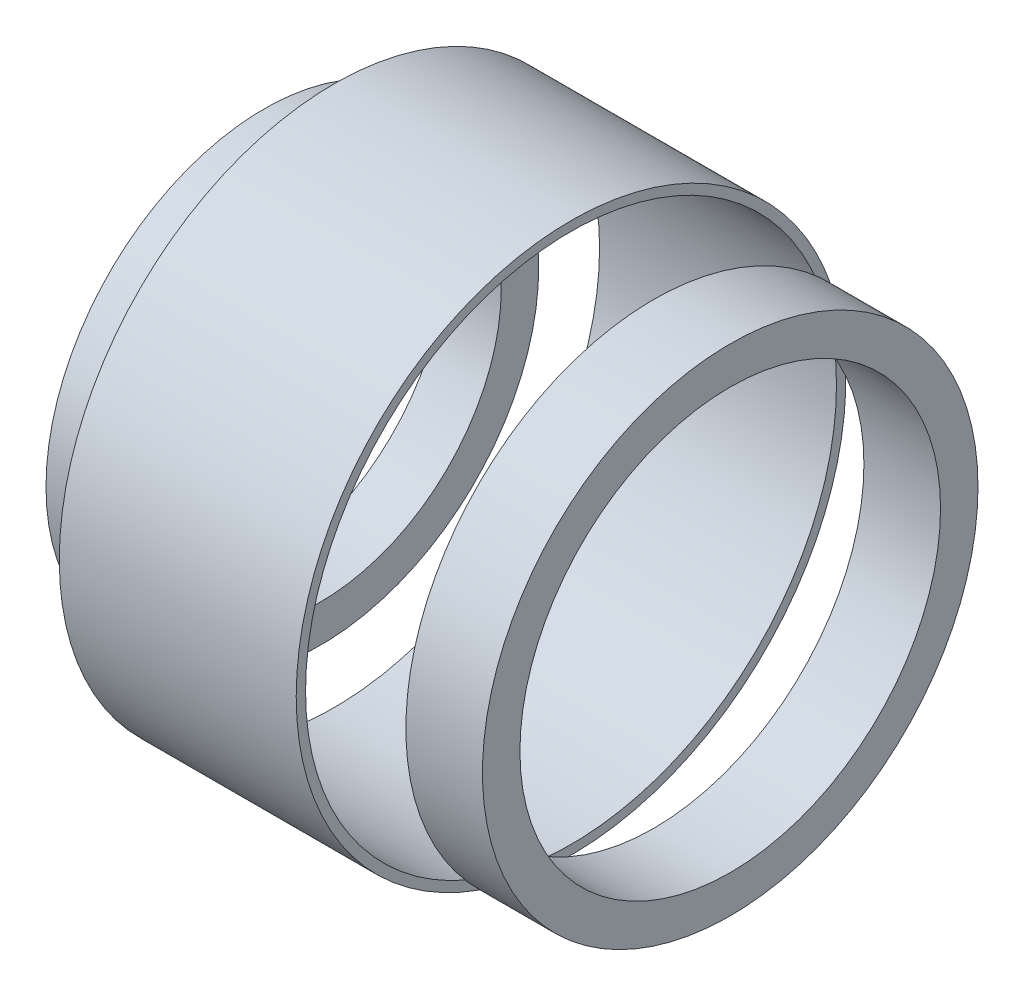
ISO-10303-21;
HEADER;
FILE_DESCRIPTION(('STEP AP214'),'2;1');
FILE_NAME('part.step','',(''),(''),'','','');
FILE_SCHEMA(('AUTOMOTIVE_DESIGN { 1 0 10303 214 1 1 1 1 }'));
ENDSEC;
DATA;
#1=APPLICATION_CONTEXT('core data for automotive mechanical design processes');
#2=APPLICATION_PROTOCOL_DEFINITION('international standard','automotive_design',2000,#1);
#3=PRODUCT_CONTEXT('',#1,'mechanical');
#4=PRODUCT('Part','Part','',(#3));
#5=PRODUCT_RELATED_PRODUCT_CATEGORY('part','',(#4));
#6=PRODUCT_DEFINITION_FORMATION('','',#4);
#7=PRODUCT_DEFINITION_CONTEXT('part definition',#1,'design');
#8=PRODUCT_DEFINITION('design','',#6,#7);
#9=PRODUCT_DEFINITION_SHAPE('','',#8);
#10=(LENGTH_UNIT() NAMED_UNIT(*) SI_UNIT(.MILLI.,.METRE.));
#11=(NAMED_UNIT(*) PLANE_ANGLE_UNIT() SI_UNIT($,.RADIAN.));
#12=(NAMED_UNIT(*) SI_UNIT($,.STERADIAN.) SOLID_ANGLE_UNIT());
#13=UNCERTAINTY_MEASURE_WITH_UNIT(LENGTH_MEASURE(1.E-05),#10,'distance_accuracy_value','');
#14=(GEOMETRIC_REPRESENTATION_CONTEXT(3) GLOBAL_UNCERTAINTY_ASSIGNED_CONTEXT((#13)) GLOBAL_UNIT_ASSIGNED_CONTEXT((#10,
#11,#12)) REPRESENTATION_CONTEXT('',''));
#15=CARTESIAN_POINT('',(0.,0.,0.));
#16=DIRECTION('',(0.,0.,1.));
#17=DIRECTION('',(1.,0.,0.));
#18=AXIS2_PLACEMENT_3D('',#15,#16,#17);
#19=CARTESIAN_POINT('',(-61.90000004,0.,-23.29375));
#20=DIRECTION('',(-1.,0.,0.));
#21=DIRECTION('',(0.,0.,1.));
#22=AXIS2_PLACEMENT_3D('',#19,#20,#21);
#23=PLANE('',#22);
#24=CARTESIAN_POINT('',(-61.90000004,0.,0.));
#25=DIRECTION('',(-1.,0.,0.));
#26=DIRECTION('',(0.,0.,1.));
#27=AXIS2_PLACEMENT_3D('',#24,#25,#26);
#28=CIRCLE('',#27,23.29375);
#29=CARTESIAN_POINT('',(-61.90000004,0.,23.29375));
#30=VERTEX_POINT('',#29);
#31=EDGE_CURVE('E64',#30,#30,#28,.T.);
#32=ORIENTED_EDGE('',*,*,#31,.F.);
#33=EDGE_LOOP('',(#32));
#34=FACE_BOUND('',#33,.T.);
#35=CARTESIAN_POINT('',(-61.90000004,0.,0.));
#36=DIRECTION('',(-1.,0.,0.));
#37=DIRECTION('',(0.,0.,1.));
#38=AXIS2_PLACEMENT_3D('',#35,#36,#37);
#39=CIRCLE('',#38,22.5);
#40=CARTESIAN_POINT('',(-61.90000004,0.,22.5));
#41=VERTEX_POINT('',#40);
#42=EDGE_CURVE('E11',#41,#41,#39,.T.);
#43=ORIENTED_EDGE('',*,*,#42,.T.);
#44=EDGE_LOOP('',(#43));
#45=FACE_BOUND('',#44,.T.);
#46=ADVANCED_FACE('F46',(#34,#45),#23,.F.);
#47=CARTESIAN_POINT('',(-121.0609375317,0.,0.));
#48=DIRECTION('',(-1.,0.,0.));
#49=DIRECTION('',(0.,0.,1.));
#50=AXIS2_PLACEMENT_3D('',#47,#48,#49);
#51=CYLINDRICAL_SURFACE('',#50,22.5);
#52=ORIENTED_EDGE('',*,*,#42,.F.);
#53=EDGE_LOOP('',(#52));
#54=FACE_BOUND('',#53,.T.);
#55=CARTESIAN_POINT('',(-81.981249994,0.,0.));
#56=DIRECTION('',(-1.,0.,0.));
#57=DIRECTION('',(0.,0.,1.));
#58=AXIS2_PLACEMENT_3D('',#55,#56,#57);
#59=CIRCLE('',#58,22.5);
#60=CARTESIAN_POINT('',(-81.981249994,0.,22.5));
#61=VERTEX_POINT('',#60);
#62=EDGE_CURVE('E53',#61,#61,#59,.T.);
#63=ORIENTED_EDGE('',*,*,#62,.T.);
#64=EDGE_LOOP('',(#63));
#65=FACE_BOUND('',#64,.T.);
#66=ADVANCED_FACE('F73',(#54,#65),#51,.F.);
#67=CARTESIAN_POINT('',(-81.981249994,0.,-23.29375));
#68=DIRECTION('',(1.,0.,0.));
#69=DIRECTION('',(0.,0.,-1.));
#70=AXIS2_PLACEMENT_3D('',#67,#68,#69);
#71=PLANE('',#70);
#72=ORIENTED_EDGE('',*,*,#62,.F.);
#73=EDGE_LOOP('',(#72));
#74=FACE_BOUND('',#73,.T.);
#75=CARTESIAN_POINT('',(-81.981249994,0.,0.));
#76=DIRECTION('',(-1.,0.,0.));
#77=DIRECTION('',(0.,0.,1.));
#78=AXIS2_PLACEMENT_3D('',#75,#76,#77);
#79=CIRCLE('',#78,23.29375);
#80=CARTESIAN_POINT('',(-81.981249994,0.,23.29375));
#81=VERTEX_POINT('',#80);
#82=EDGE_CURVE('E59',#81,#81,#79,.T.);
#83=ORIENTED_EDGE('',*,*,#82,.T.);
#84=EDGE_LOOP('',(#83));
#85=FACE_BOUND('',#84,.T.);
#86=ADVANCED_FACE('F77',(#74,#85),#71,.F.);
#87=CARTESIAN_POINT('',(-121.0609375317,0.,0.));
#88=DIRECTION('',(-1.,0.,0.));
#89=DIRECTION('',(0.,0.,1.));
#90=AXIS2_PLACEMENT_3D('',#87,#88,#89);
#91=CYLINDRICAL_SURFACE('',#90,23.29375);
#92=ORIENTED_EDGE('',*,*,#82,.F.);
#93=EDGE_LOOP('',(#92));
#94=FACE_BOUND('',#93,.T.);
#95=ORIENTED_EDGE('',*,*,#31,.T.);
#96=EDGE_LOOP('',(#95));
#97=FACE_BOUND('',#96,.T.);
#98=ADVANCED_FACE('F70',(#94,#97),#91,.T.);
#99=CLOSED_SHELL('',(#46,#66,#86,#98));
#100=MANIFOLD_SOLID_BREP('B2',#99);
#101=CARTESIAN_POINT('',(25.716228569532,0.,0.));
#102=DIRECTION('',(1.,0.,0.));
#103=DIRECTION('',(0.,0.,-1.));
#104=AXIS2_PLACEMENT_3D('',#101,#102,#103);
#105=CYLINDRICAL_SURFACE('',#104,18.499999957);
#106=CARTESIAN_POINT('',(-87.90000008,0.,0.));
#107=DIRECTION('',(1.,0.,0.));
#108=DIRECTION('',(0.,0.,-1.));
#109=AXIS2_PLACEMENT_3D('',#106,#107,#108);
#110=CIRCLE('',#109,18.499999957);
#111=CARTESIAN_POINT('',(-87.90000008,0.,-18.499999957));
#112=VERTEX_POINT('',#111);
#113=EDGE_CURVE('E45',#112,#112,#110,.T.);
#114=ORIENTED_EDGE('',*,*,#113,.T.);
#115=EDGE_LOOP('',(#114));
#116=FACE_BOUND('',#115,.T.);
#117=CARTESIAN_POINT('',(-83.13750008,0.,0.));
#118=DIRECTION('',(1.,0.,0.));
#119=DIRECTION('',(0.,0.,-1.));
#120=AXIS2_PLACEMENT_3D('',#117,#118,#119);
#121=CIRCLE('',#120,18.499999957);
#122=CARTESIAN_POINT('',(-83.13750008,0.,-18.499999957));
#123=VERTEX_POINT('',#122);
#124=EDGE_CURVE('E139',#123,#123,#121,.T.);
#125=ORIENTED_EDGE('',*,*,#124,.F.);
#126=EDGE_LOOP('',(#125));
#127=FACE_BOUND('',#126,.T.);
#128=ADVANCED_FACE('F121',(#116,#127),#105,.T.);
#129=CARTESIAN_POINT('',(-87.90000008,0.,0.));
#130=DIRECTION('',(-1.,0.,0.));
#131=DIRECTION('',(0.,0.,1.));
#132=AXIS2_PLACEMENT_3D('',#129,#130,#131);
#133=PLANE('',#132);
#134=CARTESIAN_POINT('',(-87.90000008,0.,0.));
#135=DIRECTION('',(1.,0.,0.));
#136=DIRECTION('',(0.,0.,-1.));
#137=AXIS2_PLACEMENT_3D('',#134,#135,#136);
#138=CIRCLE('',#137,15.324999957);
#139=CARTESIAN_POINT('',(-87.90000008,0.,-15.324999957));
#140=VERTEX_POINT('',#139);
#141=EDGE_CURVE('E128',#140,#140,#138,.T.);
#142=ORIENTED_EDGE('',*,*,#141,.T.);
#143=EDGE_LOOP('',(#142));
#144=FACE_BOUND('',#143,.T.);
#145=ORIENTED_EDGE('',*,*,#113,.F.);
#146=EDGE_LOOP('',(#145));
#147=FACE_BOUND('',#146,.T.);
#148=ADVANCED_FACE('F148',(#144,#147),#133,.T.);
#149=CARTESIAN_POINT('',(25.716228569532,0.,0.));
#150=DIRECTION('',(1.,0.,0.));
#151=DIRECTION('',(0.,0.,-1.));
#152=AXIS2_PLACEMENT_3D('',#149,#150,#151);
#153=CYLINDRICAL_SURFACE('',#152,15.324999957);
#154=ORIENTED_EDGE('',*,*,#141,.F.);
#155=EDGE_LOOP('',(#154));
#156=FACE_BOUND('',#155,.T.);
#157=CARTESIAN_POINT('',(-83.13750008,0.,0.));
#158=DIRECTION('',(1.,0.,0.));
#159=DIRECTION('',(0.,0.,-1.));
#160=AXIS2_PLACEMENT_3D('',#157,#158,#159);
#161=CIRCLE('',#160,15.324999957);
#162=CARTESIAN_POINT('',(-83.13750008,0.,-15.324999957));
#163=VERTEX_POINT('',#162);
#164=EDGE_CURVE('E134',#163,#163,#161,.T.);
#165=ORIENTED_EDGE('',*,*,#164,.T.);
#166=EDGE_LOOP('',(#165));
#167=FACE_BOUND('',#166,.T.);
#168=ADVANCED_FACE('F152',(#156,#167),#153,.F.);
#169=CARTESIAN_POINT('',(-83.13750008,0.,0.));
#170=DIRECTION('',(-1.,0.,0.));
#171=DIRECTION('',(0.,0.,1.));
#172=AXIS2_PLACEMENT_3D('',#169,#170,#171);
#173=PLANE('',#172);
#174=ORIENTED_EDGE('',*,*,#164,.F.);
#175=EDGE_LOOP('',(#174));
#176=FACE_BOUND('',#175,.T.);
#177=ORIENTED_EDGE('',*,*,#124,.T.);
#178=EDGE_LOOP('',(#177));
#179=FACE_BOUND('',#178,.T.);
#180=ADVANCED_FACE('F145',(#176,#179),#173,.F.);
#181=CLOSED_SHELL('',(#128,#148,#168,#180));
#182=MANIFOLD_SOLID_BREP('B6',#181);
#183=CARTESIAN_POINT('',(25.716228569532,0.,0.));
#184=DIRECTION('',(1.,0.,0.));
#185=DIRECTION('',(0.,0.,-1.));
#186=AXIS2_PLACEMENT_3D('',#183,#184,#185);
#187=CYLINDRICAL_SURFACE('',#186,21.000000037);
#188=CARTESIAN_POINT('',(-54.90000004,0.,0.));
#189=DIRECTION('',(1.,0.,0.));
#190=DIRECTION('',(0.,0.,-1.));
#191=AXIS2_PLACEMENT_3D('',#188,#189,#190);
#192=CIRCLE('',#191,21.000000037);
#193=CARTESIAN_POINT('',(-54.90000004,0.,-21.000000037));
#194=VERTEX_POINT('',#193);
#195=EDGE_CURVE('E120',#194,#194,#192,.T.);
#196=ORIENTED_EDGE('',*,*,#195,.T.);
#197=EDGE_LOOP('',(#196));
#198=FACE_BOUND('',#197,.T.);
#199=CARTESIAN_POINT('',(-48.40625004,0.,0.));
#200=DIRECTION('',(1.,0.,0.));
#201=DIRECTION('',(0.,0.,-1.));
#202=AXIS2_PLACEMENT_3D('',#199,#200,#201);
#203=CIRCLE('',#202,21.000000037);
#204=CARTESIAN_POINT('',(-48.40625004,0.,-21.000000037));
#205=VERTEX_POINT('',#204);
#206=EDGE_CURVE('E212',#205,#205,#203,.T.);
#207=ORIENTED_EDGE('',*,*,#206,.F.);
#208=EDGE_LOOP('',(#207));
#209=FACE_BOUND('',#208,.T.);
#210=ADVANCED_FACE('F194',(#198,#209),#187,.T.);
#211=CARTESIAN_POINT('',(-54.90000004,0.,0.));
#212=DIRECTION('',(-1.,0.,0.));
#213=DIRECTION('',(0.,0.,1.));
#214=AXIS2_PLACEMENT_3D('',#211,#212,#213);
#215=PLANE('',#214);
#216=CARTESIAN_POINT('',(-54.90000004,0.,0.));
#217=DIRECTION('',(1.,0.,0.));
#218=DIRECTION('',(0.,0.,-1.));
#219=AXIS2_PLACEMENT_3D('',#216,#217,#218);
#220=CIRCLE('',#219,17.825000037);
#221=CARTESIAN_POINT('',(-54.90000004,0.,-17.825000037));
#222=VERTEX_POINT('',#221);
#223=EDGE_CURVE('E201',#222,#222,#220,.T.);
#224=ORIENTED_EDGE('',*,*,#223,.T.);
#225=EDGE_LOOP('',(#224));
#226=FACE_BOUND('',#225,.T.);
#227=ORIENTED_EDGE('',*,*,#195,.F.);
#228=EDGE_LOOP('',(#227));
#229=FACE_BOUND('',#228,.T.);
#230=ADVANCED_FACE('F221',(#226,#229),#215,.T.);
#231=CARTESIAN_POINT('',(25.716228569532,0.,0.));
#232=DIRECTION('',(1.,0.,0.));
#233=DIRECTION('',(0.,0.,-1.));
#234=AXIS2_PLACEMENT_3D('',#231,#232,#233);
#235=CYLINDRICAL_SURFACE('',#234,17.825000037);
#236=ORIENTED_EDGE('',*,*,#223,.F.);
#237=EDGE_LOOP('',(#236));
#238=FACE_BOUND('',#237,.T.);
#239=CARTESIAN_POINT('',(-48.40625004,0.,0.));
#240=DIRECTION('',(1.,0.,0.));
#241=DIRECTION('',(0.,0.,-1.));
#242=AXIS2_PLACEMENT_3D('',#239,#240,#241);
#243=CIRCLE('',#242,17.825000037);
#244=CARTESIAN_POINT('',(-48.40625004,0.,-17.825000037));
#245=VERTEX_POINT('',#244);
#246=EDGE_CURVE('E206',#245,#245,#243,.T.);
#247=ORIENTED_EDGE('',*,*,#246,.T.);
#248=EDGE_LOOP('',(#247));
#249=FACE_BOUND('',#248,.T.);
#250=ADVANCED_FACE('F225',(#238,#249),#235,.F.);
#251=CARTESIAN_POINT('',(-48.40625004,0.,0.));
#252=DIRECTION('',(-1.,0.,0.));
#253=DIRECTION('',(0.,0.,1.));
#254=AXIS2_PLACEMENT_3D('',#251,#252,#253);
#255=PLANE('',#254);
#256=ORIENTED_EDGE('',*,*,#246,.F.);
#257=EDGE_LOOP('',(#256));
#258=FACE_BOUND('',#257,.T.);
#259=ORIENTED_EDGE('',*,*,#206,.T.);
#260=EDGE_LOOP('',(#259));
#261=FACE_BOUND('',#260,.T.);
#262=ADVANCED_FACE('F218',(#258,#261),#255,.F.);
#263=CLOSED_SHELL('',(#210,#230,#250,#262));
#264=MANIFOLD_SOLID_BREP('B40',#263);
#265=ADVANCED_BREP_SHAPE_REPRESENTATION('',(#18,#100,#182,#264),#14);
#266=SHAPE_DEFINITION_REPRESENTATION(#9,#265);
ENDSEC;
END-ISO-10303-21;
